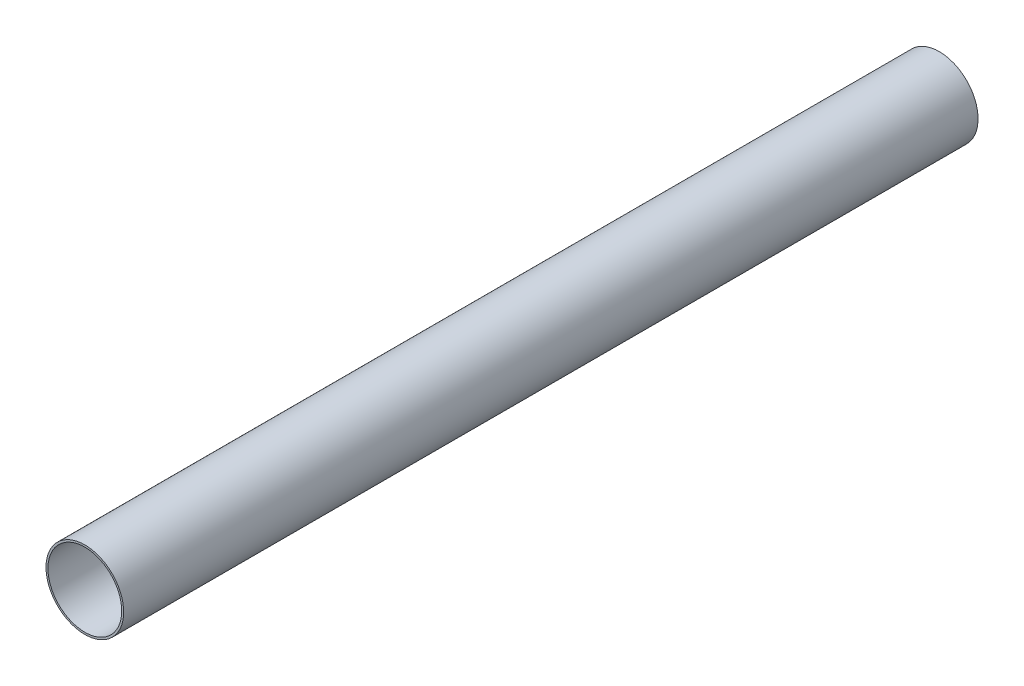
ISO-10303-21;
HEADER;
FILE_DESCRIPTION(('STEP AP214'),'2;1');
FILE_NAME('part.step','',(''),(''),'','','');
FILE_SCHEMA(('AUTOMOTIVE_DESIGN { 1 0 10303 214 1 1 1 1 }'));
ENDSEC;
DATA;
#1=APPLICATION_CONTEXT('core data for automotive mechanical design processes');
#2=APPLICATION_PROTOCOL_DEFINITION('international standard','automotive_design',2000,#1);
#3=PRODUCT_CONTEXT('',#1,'mechanical');
#4=PRODUCT('Part','Part','',(#3));
#5=PRODUCT_RELATED_PRODUCT_CATEGORY('part','',(#4));
#6=PRODUCT_DEFINITION_FORMATION('','',#4);
#7=PRODUCT_DEFINITION_CONTEXT('part definition',#1,'design');
#8=PRODUCT_DEFINITION('design','',#6,#7);
#9=PRODUCT_DEFINITION_SHAPE('','',#8);
#10=(LENGTH_UNIT() NAMED_UNIT(*) SI_UNIT(.MILLI.,.METRE.));
#11=(NAMED_UNIT(*) PLANE_ANGLE_UNIT() SI_UNIT($,.RADIAN.));
#12=(NAMED_UNIT(*) SI_UNIT($,.STERADIAN.) SOLID_ANGLE_UNIT());
#13=UNCERTAINTY_MEASURE_WITH_UNIT(LENGTH_MEASURE(1.E-05),#10,'distance_accuracy_value','');
#14=(GEOMETRIC_REPRESENTATION_CONTEXT(3) GLOBAL_UNCERTAINTY_ASSIGNED_CONTEXT((#13)) GLOBAL_UNIT_ASSIGNED_CONTEXT((#10,
#11,#12)) REPRESENTATION_CONTEXT('',''));
#15=CARTESIAN_POINT('',(0.,0.,0.));
#16=DIRECTION('',(0.,0.,1.));
#17=DIRECTION('',(1.,0.,0.));
#18=AXIS2_PLACEMENT_3D('',#15,#16,#17);
#19=CARTESIAN_POINT('',(-70.6856781186548,70.7106781186547,387.35));
#20=DIRECTION('',(0.,0.,-1.));
#21=DIRECTION('',(-1.,0.,0.));
#22=AXIS2_PLACEMENT_3D('',#19,#20,#21);
#23=CYLINDRICAL_SURFACE('',#22,10.);
#24=CARTESIAN_POINT('',(-70.6856781186548,70.7106781186547,181.9));
#25=DIRECTION('',(0.,0.,-1.));
#26=DIRECTION('',(-1.,0.,0.));
#27=AXIS2_PLACEMENT_3D('',#24,#25,#26);
#28=CIRCLE('',#27,10.);
#29=CARTESIAN_POINT('',(-80.6856781186548,70.7106781186547,181.9));
#30=VERTEX_POINT('',#29);
#31=EDGE_CURVE('E10',#30,#30,#28,.T.);
#32=ORIENTED_EDGE('',*,*,#31,.T.);
#33=EDGE_LOOP('',(#32));
#34=FACE_BOUND('',#33,.T.);
#35=CARTESIAN_POINT('',(-70.6856781186548,70.7106781186547,-38.1));
#36=DIRECTION('',(0.,0.,-1.));
#37=DIRECTION('',(-1.,0.,0.));
#38=AXIS2_PLACEMENT_3D('',#35,#36,#37);
#39=CIRCLE('',#38,10.);
#40=CARTESIAN_POINT('',(-80.6856781186548,70.7106781186547,-38.1));
#41=VERTEX_POINT('',#40);
#42=EDGE_CURVE('E54',#41,#41,#39,.T.);
#43=ORIENTED_EDGE('',*,*,#42,.F.);
#44=EDGE_LOOP('',(#43));
#45=FACE_BOUND('',#44,.T.);
#46=ADVANCED_FACE('F37',(#34,#45),#23,.T.);
#47=CARTESIAN_POINT('',(-60.6856781186548,70.7106781186547,181.9));
#48=DIRECTION('',(0.,0.,1.));
#49=DIRECTION('',(1.,0.,0.));
#50=AXIS2_PLACEMENT_3D('',#47,#48,#49);
#51=PLANE('',#50);
#52=CARTESIAN_POINT('',(-70.6856781186548,70.7106781186547,181.9));
#53=DIRECTION('',(0.,0.,-1.));
#54=DIRECTION('',(-1.,0.,0.));
#55=AXIS2_PLACEMENT_3D('',#52,#53,#54);
#56=CIRCLE('',#55,9.49999999999999);
#57=CARTESIAN_POINT('',(-80.1856781186548,70.7106781186547,181.9));
#58=VERTEX_POINT('',#57);
#59=EDGE_CURVE('E44',#58,#58,#56,.T.);
#60=ORIENTED_EDGE('',*,*,#59,.T.);
#61=EDGE_LOOP('',(#60));
#62=FACE_BOUND('',#61,.T.);
#63=ORIENTED_EDGE('',*,*,#31,.F.);
#64=EDGE_LOOP('',(#63));
#65=FACE_BOUND('',#64,.T.);
#66=ADVANCED_FACE('F65',(#62,#65),#51,.T.);
#67=CARTESIAN_POINT('',(-70.6856781186548,70.7106781186547,387.35));
#68=DIRECTION('',(0.,0.,-1.));
#69=DIRECTION('',(-1.,0.,0.));
#70=AXIS2_PLACEMENT_3D('',#67,#68,#69);
#71=CYLINDRICAL_SURFACE('',#70,9.5);
#72=CARTESIAN_POINT('',(-70.6856781186548,70.7106781186547,-38.1));
#73=DIRECTION('',(0.,0.,-1.));
#74=DIRECTION('',(-1.,0.,0.));
#75=AXIS2_PLACEMENT_3D('',#72,#73,#74);
#76=CIRCLE('',#75,9.5);
#77=CARTESIAN_POINT('',(-80.1856781186548,70.7106781186547,-38.1));
#78=VERTEX_POINT('',#77);
#79=EDGE_CURVE('E49',#78,#78,#76,.T.);
#80=ORIENTED_EDGE('',*,*,#79,.T.);
#81=EDGE_LOOP('',(#80));
#82=FACE_BOUND('',#81,.T.);
#83=ORIENTED_EDGE('',*,*,#59,.F.);
#84=EDGE_LOOP('',(#83));
#85=FACE_BOUND('',#84,.T.);
#86=ADVANCED_FACE('F69',(#82,#85),#71,.F.);
#87=CARTESIAN_POINT('',(-61.1856781186548,70.7106781186547,-38.1));
#88=DIRECTION('',(0.,0.,-1.));
#89=DIRECTION('',(-1.,0.,0.));
#90=AXIS2_PLACEMENT_3D('',#87,#88,#89);
#91=PLANE('',#90);
#92=ORIENTED_EDGE('',*,*,#42,.T.);
#93=EDGE_LOOP('',(#92));
#94=FACE_BOUND('',#93,.T.);
#95=ORIENTED_EDGE('',*,*,#79,.F.);
#96=EDGE_LOOP('',(#95));
#97=FACE_BOUND('',#96,.T.);
#98=ADVANCED_FACE('F61',(#94,#97),#91,.T.);
#99=CLOSED_SHELL('',(#46,#66,#86,#98));
#100=MANIFOLD_SOLID_BREP('B2',#99);
#101=ADVANCED_BREP_SHAPE_REPRESENTATION('',(#18,#100),#14);
#102=SHAPE_DEFINITION_REPRESENTATION(#9,#101);
ENDSEC;
END-ISO-10303-21;
